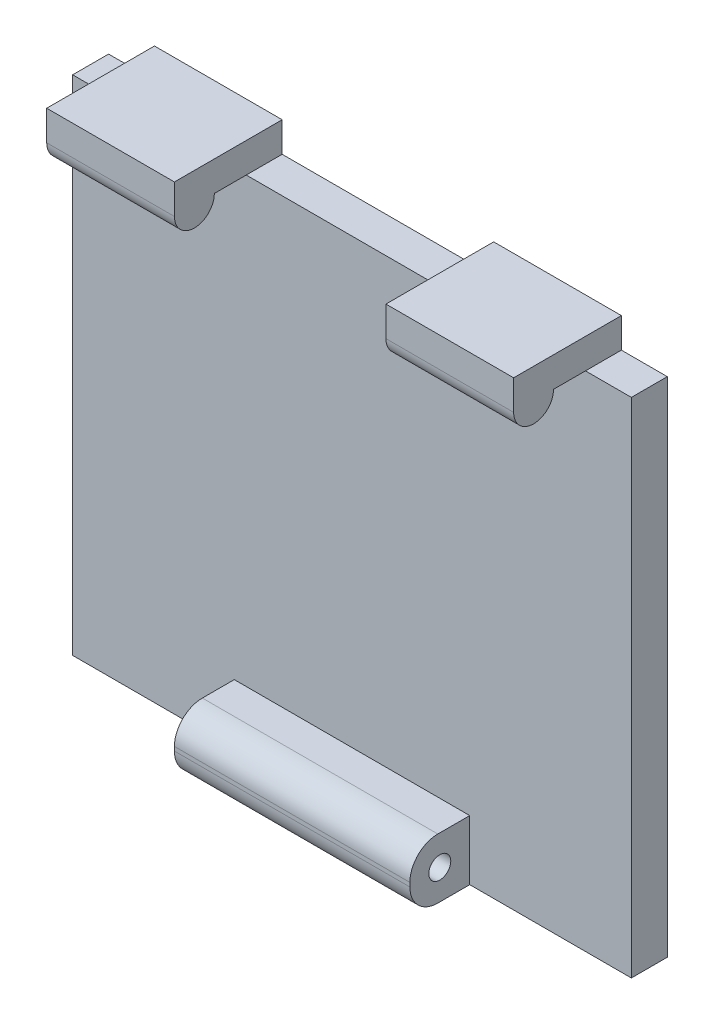
ISO-10303-21;
HEADER;
FILE_DESCRIPTION(('STEP AP214'),'2;1');
FILE_NAME('part.step','',(''),(''),'','','');
FILE_SCHEMA(('AUTOMOTIVE_DESIGN { 1 0 10303 214 1 1 1 1 }'));
ENDSEC;
DATA;
#1=APPLICATION_CONTEXT('core data for automotive mechanical design processes');
#2=APPLICATION_PROTOCOL_DEFINITION('international standard','automotive_design',2000,#1);
#3=PRODUCT_CONTEXT('',#1,'mechanical');
#4=PRODUCT('Part','Part','',(#3));
#5=PRODUCT_RELATED_PRODUCT_CATEGORY('part','',(#4));
#6=PRODUCT_DEFINITION_FORMATION('','',#4);
#7=PRODUCT_DEFINITION_CONTEXT('part definition',#1,'design');
#8=PRODUCT_DEFINITION('design','',#6,#7);
#9=PRODUCT_DEFINITION_SHAPE('','',#8);
#10=(LENGTH_UNIT() NAMED_UNIT(*) SI_UNIT(.MILLI.,.METRE.));
#11=(NAMED_UNIT(*) PLANE_ANGLE_UNIT() SI_UNIT($,.RADIAN.));
#12=(NAMED_UNIT(*) SI_UNIT($,.STERADIAN.) SOLID_ANGLE_UNIT());
#13=UNCERTAINTY_MEASURE_WITH_UNIT(LENGTH_MEASURE(1.E-05),#10,'distance_accuracy_value','');
#14=(GEOMETRIC_REPRESENTATION_CONTEXT(3) GLOBAL_UNCERTAINTY_ASSIGNED_CONTEXT((#13)) GLOBAL_UNIT_ASSIGNED_CONTEXT((#10,
#11,#12)) REPRESENTATION_CONTEXT('',''));
#15=CARTESIAN_POINT('',(0.,0.,0.));
#16=DIRECTION('',(0.,0.,1.));
#17=DIRECTION('',(1.,0.,0.));
#18=AXIS2_PLACEMENT_3D('',#15,#16,#17);
#19=CARTESIAN_POINT('',(0.,0.,1.8));
#20=DIRECTION('',(0.,0.,1.));
#21=DIRECTION('',(1.,0.,0.));
#22=AXIS2_PLACEMENT_3D('',#19,#20,#21);
#23=PLANE('',#22);
#24=DIRECTION('',(-1.,0.,0.));
#25=VECTOR('',#24,1.);
#26=CARTESIAN_POINT('',(0.,0.,1.8));
#27=LINE('',#26,#25);
#28=CARTESIAN_POINT('',(28.,0.,1.8));
#29=VERTEX_POINT('',#28);
#30=CARTESIAN_POINT('',(25.7,0.,1.8));
#31=VERTEX_POINT('',#30);
#32=EDGE_CURVE('E294',#29,#31,#27,.T.);
#33=ORIENTED_EDGE('',*,*,#32,.T.);
#34=DIRECTION('',(1.,0.,0.));
#35=VECTOR('',#34,1.);
#36=CARTESIAN_POINT('',(19.3,0.,1.8));
#37=LINE('',#36,#35);
#38=CARTESIAN_POINT('',(19.3,0.,1.8));
#39=VERTEX_POINT('',#38);
#40=EDGE_CURVE('E391',#39,#31,#37,.T.);
#41=ORIENTED_EDGE('',*,*,#40,.F.);
#42=CARTESIAN_POINT('',(8.7,0.,1.8));
#43=VERTEX_POINT('',#42);
#44=EDGE_CURVE('E298',#39,#43,#27,.T.);
#45=ORIENTED_EDGE('',*,*,#44,.T.);
#46=DIRECTION('',(1.,0.,0.));
#47=VECTOR('',#46,1.);
#48=CARTESIAN_POINT('',(2.3,0.,1.8));
#49=LINE('',#48,#47);
#50=CARTESIAN_POINT('',(2.3,0.,1.8));
#51=VERTEX_POINT('',#50);
#52=EDGE_CURVE('E208',#51,#43,#49,.T.);
#53=ORIENTED_EDGE('',*,*,#52,.F.);
#54=CARTESIAN_POINT('',(0.,0.,1.8));
#55=VERTEX_POINT('',#54);
#56=EDGE_CURVE('E293',#51,#55,#27,.T.);
#57=ORIENTED_EDGE('',*,*,#56,.T.);
#58=DIRECTION('',(0.,-1.,0.));
#59=VECTOR('',#58,1.);
#60=CARTESIAN_POINT('',(0.,0.,1.8));
#61=LINE('',#60,#59);
#62=CARTESIAN_POINT('',(0.,-25.2,1.8));
#63=VERTEX_POINT('',#62);
#64=EDGE_CURVE('E284',#55,#63,#61,.T.);
#65=ORIENTED_EDGE('',*,*,#64,.T.);
#66=DIRECTION('',(1.,0.,0.));
#67=VECTOR('',#66,1.);
#68=CARTESIAN_POINT('',(0.,-25.2,1.8));
#69=LINE('',#68,#67);
#70=CARTESIAN_POINT('',(8.1,-25.2,1.8));
#71=VERTEX_POINT('',#70);
#72=EDGE_CURVE('E288',#63,#71,#69,.T.);
#73=ORIENTED_EDGE('',*,*,#72,.T.);
#74=DIRECTION('',(0.,-1.,0.));
#75=VECTOR('',#74,1.);
#76=CARTESIAN_POINT('',(8.1,-25.2,1.8));
#77=LINE('',#76,#75);
#78=CARTESIAN_POINT('',(8.1,-22.2,1.8));
#79=VERTEX_POINT('',#78);
#80=EDGE_CURVE('E260',#79,#71,#77,.T.);
#81=ORIENTED_EDGE('',*,*,#80,.F.);
#82=DIRECTION('',(-1.,0.,0.));
#83=VECTOR('',#82,1.);
#84=CARTESIAN_POINT('',(8.1,-22.2,1.8));
#85=LINE('',#84,#83);
#86=CARTESIAN_POINT('',(19.9,-22.2,1.8));
#87=VERTEX_POINT('',#86);
#88=EDGE_CURVE('E265',#87,#79,#85,.T.);
#89=ORIENTED_EDGE('',*,*,#88,.F.);
#90=DIRECTION('',(0.,1.,0.));
#91=VECTOR('',#90,1.);
#92=CARTESIAN_POINT('',(19.9,-25.2,1.8));
#93=LINE('',#92,#91);
#94=CARTESIAN_POINT('',(19.9,-25.2,1.8));
#95=VERTEX_POINT('',#94);
#96=EDGE_CURVE('E271',#95,#87,#93,.T.);
#97=ORIENTED_EDGE('',*,*,#96,.F.);
#98=CARTESIAN_POINT('',(28.,-25.2,1.8));
#99=VERTEX_POINT('',#98);
#100=EDGE_CURVE('E287',#95,#99,#69,.T.);
#101=ORIENTED_EDGE('',*,*,#100,.T.);
#102=DIRECTION('',(0.,1.,0.));
#103=VECTOR('',#102,1.);
#104=CARTESIAN_POINT('',(28.,0.,1.8));
#105=LINE('',#104,#103);
#106=EDGE_CURVE('E291',#99,#29,#105,.T.);
#107=ORIENTED_EDGE('',*,*,#106,.T.);
#108=EDGE_LOOP('',(#33,#41,#45,#53,#57,#65,#73,#81,#89,#97,#101,#107));
#109=FACE_BOUND('',#108,.T.);
#110=ADVANCED_FACE('F33',(#109),#23,.T.);
#111=CARTESIAN_POINT('',(0.,0.,1.8));
#112=DIRECTION('',(0.,-1.,0.));
#113=DIRECTION('',(0.,0.,-1.));
#114=AXIS2_PLACEMENT_3D('',#111,#112,#113);
#115=PLANE('',#114);
#116=DIRECTION('',(0.,0.,1.));
#117=VECTOR('',#116,1.);
#118=CARTESIAN_POINT('',(19.3,0.,0.));
#119=LINE('',#118,#117);
#120=CARTESIAN_POINT('',(19.3,0.,0.));
#121=VERTEX_POINT('',#120);
#122=EDGE_CURVE('E221',#121,#39,#119,.T.);
#123=ORIENTED_EDGE('',*,*,#122,.F.);
#124=DIRECTION('',(-1.,0.,0.));
#125=VECTOR('',#124,1.);
#126=CARTESIAN_POINT('',(0.,0.,0.));
#127=LINE('',#126,#125);
#128=CARTESIAN_POINT('',(8.7,0.,0.));
#129=VERTEX_POINT('',#128);
#130=EDGE_CURVE('E307',#121,#129,#127,.T.);
#131=ORIENTED_EDGE('',*,*,#130,.T.);
#132=DIRECTION('',(0.,0.,-1.));
#133=VECTOR('',#132,1.);
#134=CARTESIAN_POINT('',(8.7,0.,0.));
#135=LINE('',#134,#133);
#136=EDGE_CURVE('E241',#43,#129,#135,.T.);
#137=ORIENTED_EDGE('',*,*,#136,.F.);
#138=ORIENTED_EDGE('',*,*,#44,.F.);
#139=EDGE_LOOP('',(#123,#131,#137,#138));
#140=FACE_BOUND('',#139,.T.);
#141=ADVANCED_FACE('F400',(#140),#115,.F.);
#142=DIRECTION('',(0.,0.,-1.));
#143=VECTOR('',#142,1.);
#144=CARTESIAN_POINT('',(25.7,0.,0.));
#145=LINE('',#144,#143);
#146=CARTESIAN_POINT('',(25.7,0.,0.));
#147=VERTEX_POINT('',#146);
#148=EDGE_CURVE('E225',#31,#147,#145,.T.);
#149=ORIENTED_EDGE('',*,*,#148,.F.);
#150=ORIENTED_EDGE('',*,*,#32,.F.);
#151=DIRECTION('',(0.,0.,-1.));
#152=VECTOR('',#151,1.);
#153=CARTESIAN_POINT('',(28.,0.,1.8));
#154=LINE('',#153,#152);
#155=CARTESIAN_POINT('',(28.,0.,0.));
#156=VERTEX_POINT('',#155);
#157=EDGE_CURVE('E310',#29,#156,#154,.T.);
#158=ORIENTED_EDGE('',*,*,#157,.T.);
#159=EDGE_CURVE('E48',#156,#147,#127,.T.);
#160=ORIENTED_EDGE('',*,*,#159,.T.);
#161=EDGE_LOOP('',(#149,#150,#158,#160));
#162=FACE_BOUND('',#161,.T.);
#163=ADVANCED_FACE('F388',(#162),#115,.F.);
#164=DIRECTION('',(0.,0.,1.));
#165=VECTOR('',#164,1.);
#166=CARTESIAN_POINT('',(2.3,0.,0.));
#167=LINE('',#166,#165);
#168=CARTESIAN_POINT('',(2.3,0.,0.));
#169=VERTEX_POINT('',#168);
#170=EDGE_CURVE('E56',#169,#51,#167,.T.);
#171=ORIENTED_EDGE('',*,*,#170,.F.);
#172=CARTESIAN_POINT('',(0.,0.,0.));
#173=VERTEX_POINT('',#172);
#174=EDGE_CURVE('E305',#169,#173,#127,.T.);
#175=ORIENTED_EDGE('',*,*,#174,.T.);
#176=DIRECTION('',(0.,0.,-1.));
#177=VECTOR('',#176,1.);
#178=CARTESIAN_POINT('',(0.,0.,1.8));
#179=LINE('',#178,#177);
#180=EDGE_CURVE('E297',#55,#173,#179,.T.);
#181=ORIENTED_EDGE('',*,*,#180,.F.);
#182=ORIENTED_EDGE('',*,*,#56,.F.);
#183=EDGE_LOOP('',(#171,#175,#181,#182));
#184=FACE_BOUND('',#183,.T.);
#185=ADVANCED_FACE('F409',(#184),#115,.F.);
#186=CARTESIAN_POINT('',(0.,0.,1.8));
#187=DIRECTION('',(1.,0.,0.));
#188=DIRECTION('',(0.,1.,0.));
#189=AXIS2_PLACEMENT_3D('',#186,#187,#188);
#190=PLANE('',#189);
#191=DIRECTION('',(0.,-1.,0.));
#192=VECTOR('',#191,1.);
#193=CARTESIAN_POINT('',(0.,0.,0.));
#194=LINE('',#193,#192);
#195=CARTESIAN_POINT('',(0.,-25.2,0.));
#196=VERTEX_POINT('',#195);
#197=EDGE_CURVE('E283',#173,#196,#194,.T.);
#198=ORIENTED_EDGE('',*,*,#197,.T.);
#199=DIRECTION('',(0.,0.,-1.));
#200=VECTOR('',#199,1.);
#201=CARTESIAN_POINT('',(0.,-25.2,1.8));
#202=LINE('',#201,#200);
#203=EDGE_CURVE('E315',#63,#196,#202,.T.);
#204=ORIENTED_EDGE('',*,*,#203,.F.);
#205=ORIENTED_EDGE('',*,*,#64,.F.);
#206=ORIENTED_EDGE('',*,*,#180,.T.);
#207=EDGE_LOOP('',(#198,#204,#205,#206));
#208=FACE_BOUND('',#207,.T.);
#209=ADVANCED_FACE('F367',(#208),#190,.F.);
#210=CARTESIAN_POINT('',(0.,-25.2,1.8));
#211=DIRECTION('',(0.,1.,0.));
#212=DIRECTION('',(0.,0.,1.));
#213=AXIS2_PLACEMENT_3D('',#210,#211,#212);
#214=PLANE('',#213);
#215=DIRECTION('',(0.,0.,-1.));
#216=VECTOR('',#215,1.);
#217=CARTESIAN_POINT('',(19.9,-25.2,4.8));
#218=LINE('',#217,#216);
#219=CARTESIAN_POINT('',(19.9,-25.2,3.4));
#220=VERTEX_POINT('',#219);
#221=EDGE_CURVE('E279',#220,#95,#218,.T.);
#222=ORIENTED_EDGE('',*,*,#221,.F.);
#223=DIRECTION('',(1.,0.,0.));
#224=VECTOR('',#223,1.);
#225=CARTESIAN_POINT('',(0.,-25.2,3.4));
#226=LINE('',#225,#224);
#227=CARTESIAN_POINT('',(8.1,-25.2,3.4));
#228=VERTEX_POINT('',#227);
#229=EDGE_CURVE('E11',#220,#228,#226,.F.);
#230=ORIENTED_EDGE('',*,*,#229,.T.);
#231=DIRECTION('',(0.,0.,-1.));
#232=VECTOR('',#231,1.);
#233=CARTESIAN_POINT('',(8.1,-25.2,4.8));
#234=LINE('',#233,#232);
#235=EDGE_CURVE('E281',#228,#71,#234,.T.);
#236=ORIENTED_EDGE('',*,*,#235,.T.);
#237=ORIENTED_EDGE('',*,*,#72,.F.);
#238=ORIENTED_EDGE('',*,*,#203,.T.);
#239=DIRECTION('',(1.,0.,0.));
#240=VECTOR('',#239,1.);
#241=CARTESIAN_POINT('',(0.,-25.2,0.));
#242=LINE('',#241,#240);
#243=CARTESIAN_POINT('',(28.,-25.2,0.));
#244=VERTEX_POINT('',#243);
#245=EDGE_CURVE('E301',#196,#244,#242,.T.);
#246=ORIENTED_EDGE('',*,*,#245,.T.);
#247=DIRECTION('',(0.,0.,-1.));
#248=VECTOR('',#247,1.);
#249=CARTESIAN_POINT('',(28.,-25.2,1.8));
#250=LINE('',#249,#248);
#251=EDGE_CURVE('E312',#99,#244,#250,.T.);
#252=ORIENTED_EDGE('',*,*,#251,.F.);
#253=ORIENTED_EDGE('',*,*,#100,.F.);
#254=EDGE_LOOP('',(#222,#230,#236,#237,#238,#246,#252,#253));
#255=FACE_BOUND('',#254,.T.);
#256=ADVANCED_FACE('F357',(#255),#214,.F.);
#257=CARTESIAN_POINT('',(28.,0.,1.8));
#258=DIRECTION('',(-1.,0.,0.));
#259=DIRECTION('',(0.,-1.,0.));
#260=AXIS2_PLACEMENT_3D('',#257,#258,#259);
#261=PLANE('',#260);
#262=DIRECTION('',(0.,1.,0.));
#263=VECTOR('',#262,1.);
#264=CARTESIAN_POINT('',(28.,0.,0.));
#265=LINE('',#264,#263);
#266=EDGE_CURVE('E303',#244,#156,#265,.T.);
#267=ORIENTED_EDGE('',*,*,#266,.T.);
#268=ORIENTED_EDGE('',*,*,#157,.F.);
#269=ORIENTED_EDGE('',*,*,#106,.F.);
#270=ORIENTED_EDGE('',*,*,#251,.T.);
#271=EDGE_LOOP('',(#267,#268,#269,#270));
#272=FACE_BOUND('',#271,.T.);
#273=ADVANCED_FACE('F373',(#272),#261,.F.);
#274=CARTESIAN_POINT('',(0.,0.,0.));
#275=DIRECTION('',(0.,0.,1.));
#276=DIRECTION('',(1.,0.,0.));
#277=AXIS2_PLACEMENT_3D('',#274,#275,#276);
#278=PLANE('',#277);
#279=ORIENTED_EDGE('',*,*,#197,.F.);
#280=ORIENTED_EDGE('',*,*,#174,.F.);
#281=DIRECTION('',(0.,-1.,0.));
#282=VECTOR('',#281,1.);
#283=CARTESIAN_POINT('',(2.3,1.5,0.));
#284=LINE('',#283,#282);
#285=CARTESIAN_POINT('',(2.3,1.5,0.));
#286=VERTEX_POINT('',#285);
#287=EDGE_CURVE('E245',#286,#169,#284,.T.);
#288=ORIENTED_EDGE('',*,*,#287,.F.);
#289=DIRECTION('',(-1.,0.,0.));
#290=VECTOR('',#289,1.);
#291=CARTESIAN_POINT('',(2.3,1.5,0.));
#292=LINE('',#291,#290);
#293=CARTESIAN_POINT('',(8.7,1.5,0.));
#294=VERTEX_POINT('',#293);
#295=EDGE_CURVE('E243',#294,#286,#292,.T.);
#296=ORIENTED_EDGE('',*,*,#295,.F.);
#297=DIRECTION('',(0.,-1.,0.));
#298=VECTOR('',#297,1.);
#299=CARTESIAN_POINT('',(8.7,1.5,0.));
#300=LINE('',#299,#298);
#301=EDGE_CURVE('E251',#294,#129,#300,.T.);
#302=ORIENTED_EDGE('',*,*,#301,.T.);
#303=ORIENTED_EDGE('',*,*,#130,.F.);
#304=DIRECTION('',(0.,-1.,0.));
#305=VECTOR('',#304,1.);
#306=CARTESIAN_POINT('',(19.3,1.5,0.));
#307=LINE('',#306,#305);
#308=CARTESIAN_POINT('',(19.3,1.5,0.));
#309=VERTEX_POINT('',#308);
#310=EDGE_CURVE('E229',#309,#121,#307,.T.);
#311=ORIENTED_EDGE('',*,*,#310,.F.);
#312=DIRECTION('',(-1.,0.,0.));
#313=VECTOR('',#312,1.);
#314=CARTESIAN_POINT('',(19.3,1.5,0.));
#315=LINE('',#314,#313);
#316=CARTESIAN_POINT('',(25.7,1.5,0.));
#317=VERTEX_POINT('',#316);
#318=EDGE_CURVE('E227',#317,#309,#315,.T.);
#319=ORIENTED_EDGE('',*,*,#318,.F.);
#320=DIRECTION('',(0.,-1.,0.));
#321=VECTOR('',#320,1.);
#322=CARTESIAN_POINT('',(25.7,1.5,0.));
#323=LINE('',#322,#321);
#324=EDGE_CURVE('E235',#317,#147,#323,.T.);
#325=ORIENTED_EDGE('',*,*,#324,.T.);
#326=ORIENTED_EDGE('',*,*,#159,.F.);
#327=ORIENTED_EDGE('',*,*,#266,.F.);
#328=ORIENTED_EDGE('',*,*,#245,.F.);
#329=EDGE_LOOP('',(#279,#280,#288,#296,#302,#303,#311,#319,#325,#326,#327,#328));
#330=FACE_BOUND('',#329,.T.);
#331=ADVANCED_FACE('F375',(#330),#278,.F.);
#332=CARTESIAN_POINT('',(8.1,-25.2,4.8));
#333=DIRECTION('',(1.,0.,0.));
#334=DIRECTION('',(0.,0.,-1.));
#335=AXIS2_PLACEMENT_3D('',#332,#333,#334);
#336=PLANE('',#335);
#337=CARTESIAN_POINT('',(8.1,-23.7,3.3));
#338=DIRECTION('',(1.,0.,0.));
#339=DIRECTION('',(0.,0.,-1.));
#340=AXIS2_PLACEMENT_3D('',#337,#338,#339);
#341=CIRCLE('',#340,0.549999999999998);
#342=CARTESIAN_POINT('',(8.1,-23.7,2.75));
#343=VERTEX_POINT('',#342);
#344=EDGE_CURVE('E257',#343,#343,#341,.T.);
#345=ORIENTED_EDGE('',*,*,#344,.T.);
#346=EDGE_LOOP('',(#345));
#347=FACE_BOUND('',#346,.T.);
#348=DIRECTION('',(0.,-1.,0.));
#349=VECTOR('',#348,1.);
#350=CARTESIAN_POINT('',(8.1,-25.2,4.8));
#351=LINE('',#350,#349);
#352=CARTESIAN_POINT('',(8.1,-23.6,4.8));
#353=VERTEX_POINT('',#352);
#354=CARTESIAN_POINT('',(8.1,-23.8,4.8));
#355=VERTEX_POINT('',#354);
#356=EDGE_CURVE('E261',#353,#355,#351,.T.);
#357=ORIENTED_EDGE('',*,*,#356,.F.);
#358=CARTESIAN_POINT('',(8.1,-23.6,3.4));
#359=DIRECTION('',(1.,0.,0.));
#360=DIRECTION('',(0.,0.,-1.));
#361=AXIS2_PLACEMENT_3D('',#358,#359,#360);
#362=CIRCLE('',#361,1.4);
#363=CARTESIAN_POINT('',(8.1,-22.2,3.4));
#364=VERTEX_POINT('',#363);
#365=EDGE_CURVE('E326',#353,#364,#362,.F.);
#366=ORIENTED_EDGE('',*,*,#365,.T.);
#367=DIRECTION('',(0.,0.,-1.));
#368=VECTOR('',#367,1.);
#369=CARTESIAN_POINT('',(8.1,-22.2,4.8));
#370=LINE('',#369,#368);
#371=EDGE_CURVE('E268',#364,#79,#370,.T.);
#372=ORIENTED_EDGE('',*,*,#371,.T.);
#373=ORIENTED_EDGE('',*,*,#80,.T.);
#374=ORIENTED_EDGE('',*,*,#235,.F.);
#375=CARTESIAN_POINT('',(8.1,-23.8,3.4));
#376=DIRECTION('',(1.,0.,0.));
#377=DIRECTION('',(0.,0.,-1.));
#378=AXIS2_PLACEMENT_3D('',#375,#376,#377);
#379=CIRCLE('',#378,1.4);
#380=EDGE_CURVE('E324',#228,#355,#379,.F.);
#381=ORIENTED_EDGE('',*,*,#380,.T.);
#382=EDGE_LOOP('',(#357,#366,#372,#373,#374,#381));
#383=FACE_BOUND('',#382,.T.);
#384=ADVANCED_FACE('F346',(#347,#383),#336,.F.);
#385=CARTESIAN_POINT('',(19.9,-25.2,4.8));
#386=DIRECTION('',(-1.,0.,0.));
#387=DIRECTION('',(0.,0.,1.));
#388=AXIS2_PLACEMENT_3D('',#385,#386,#387);
#389=PLANE('',#388);
#390=CARTESIAN_POINT('',(19.9,-23.7,3.3));
#391=DIRECTION('',(1.,0.,0.));
#392=DIRECTION('',(0.,0.,-1.));
#393=AXIS2_PLACEMENT_3D('',#390,#391,#392);
#394=CIRCLE('',#393,0.549999999999998);
#395=CARTESIAN_POINT('',(19.9,-23.7,2.75));
#396=VERTEX_POINT('',#395);
#397=EDGE_CURVE('E254',#396,#396,#394,.T.);
#398=ORIENTED_EDGE('',*,*,#397,.F.);
#399=EDGE_LOOP('',(#398));
#400=FACE_BOUND('',#399,.T.);
#401=DIRECTION('',(0.,0.,-1.));
#402=VECTOR('',#401,1.);
#403=CARTESIAN_POINT('',(19.9,-22.2,4.8));
#404=LINE('',#403,#402);
#405=CARTESIAN_POINT('',(19.9,-22.2,3.4));
#406=VERTEX_POINT('',#405);
#407=EDGE_CURVE('E277',#406,#87,#404,.T.);
#408=ORIENTED_EDGE('',*,*,#407,.F.);
#409=CARTESIAN_POINT('',(19.9,-23.6,3.4));
#410=DIRECTION('',(-1.,0.,0.));
#411=DIRECTION('',(0.,0.,1.));
#412=AXIS2_PLACEMENT_3D('',#409,#410,#411);
#413=CIRCLE('',#412,1.4);
#414=CARTESIAN_POINT('',(19.9,-23.6,4.8));
#415=VERTEX_POINT('',#414);
#416=EDGE_CURVE('E41',#406,#415,#413,.F.);
#417=ORIENTED_EDGE('',*,*,#416,.T.);
#418=DIRECTION('',(0.,1.,0.));
#419=VECTOR('',#418,1.);
#420=CARTESIAN_POINT('',(19.9,-25.2,4.8));
#421=LINE('',#420,#419);
#422=CARTESIAN_POINT('',(19.9,-23.8,4.8));
#423=VERTEX_POINT('',#422);
#424=EDGE_CURVE('E264',#423,#415,#421,.T.);
#425=ORIENTED_EDGE('',*,*,#424,.F.);
#426=CARTESIAN_POINT('',(19.9,-23.8,3.4));
#427=DIRECTION('',(-1.,0.,0.));
#428=DIRECTION('',(0.,0.,1.));
#429=AXIS2_PLACEMENT_3D('',#426,#427,#428);
#430=CIRCLE('',#429,1.4);
#431=EDGE_CURVE('E330',#423,#220,#430,.F.);
#432=ORIENTED_EDGE('',*,*,#431,.T.);
#433=ORIENTED_EDGE('',*,*,#221,.T.);
#434=ORIENTED_EDGE('',*,*,#96,.T.);
#435=EDGE_LOOP('',(#408,#417,#425,#432,#433,#434));
#436=FACE_BOUND('',#435,.T.);
#437=ADVANCED_FACE('F335',(#400,#436),#389,.F.);
#438=CARTESIAN_POINT('',(8.1,-22.2,4.8));
#439=DIRECTION('',(0.,-1.,0.));
#440=DIRECTION('',(0.,0.,-1.));
#441=AXIS2_PLACEMENT_3D('',#438,#439,#440);
#442=PLANE('',#441);
#443=ORIENTED_EDGE('',*,*,#371,.F.);
#444=DIRECTION('',(-1.,0.,0.));
#445=VECTOR('',#444,1.);
#446=CARTESIAN_POINT('',(8.1,-22.2,3.4));
#447=LINE('',#446,#445);
#448=EDGE_CURVE('E328',#364,#406,#447,.F.);
#449=ORIENTED_EDGE('',*,*,#448,.T.);
#450=ORIENTED_EDGE('',*,*,#407,.T.);
#451=ORIENTED_EDGE('',*,*,#88,.T.);
#452=EDGE_LOOP('',(#443,#449,#450,#451));
#453=FACE_BOUND('',#452,.T.);
#454=ADVANCED_FACE('F349',(#453),#442,.F.);
#455=CARTESIAN_POINT('',(0.,0.,4.8));
#456=DIRECTION('',(0.,0.,-1.));
#457=DIRECTION('',(-1.,0.,0.));
#458=AXIS2_PLACEMENT_3D('',#455,#456,#457);
#459=PLANE('',#458);
#460=ORIENTED_EDGE('',*,*,#424,.T.);
#461=DIRECTION('',(-1.,0.,0.));
#462=VECTOR('',#461,1.);
#463=CARTESIAN_POINT('',(0.,-23.6,4.8));
#464=LINE('',#463,#462);
#465=EDGE_CURVE('E321',#415,#353,#464,.T.);
#466=ORIENTED_EDGE('',*,*,#465,.T.);
#467=ORIENTED_EDGE('',*,*,#356,.T.);
#468=DIRECTION('',(1.,0.,0.));
#469=VECTOR('',#468,1.);
#470=CARTESIAN_POINT('',(0.,-23.8,4.8));
#471=LINE('',#470,#469);
#472=EDGE_CURVE('E318',#355,#423,#471,.T.);
#473=ORIENTED_EDGE('',*,*,#472,.T.);
#474=EDGE_LOOP('',(#460,#466,#467,#473));
#475=FACE_BOUND('',#474,.T.);
#476=ADVANCED_FACE('F340',(#475),#459,.F.);
#477=CARTESIAN_POINT('',(0.,-23.6,3.4));
#478=DIRECTION('',(-1.,0.,0.));
#479=DIRECTION('',(0.,0.,1.));
#480=AXIS2_PLACEMENT_3D('',#477,#478,#479);
#481=CYLINDRICAL_SURFACE('',#480,1.4);
#482=ORIENTED_EDGE('',*,*,#416,.F.);
#483=ORIENTED_EDGE('',*,*,#448,.F.);
#484=ORIENTED_EDGE('',*,*,#365,.F.);
#485=ORIENTED_EDGE('',*,*,#465,.F.);
#486=EDGE_LOOP('',(#482,#483,#484,#485));
#487=FACE_BOUND('',#486,.T.);
#488=ADVANCED_FACE('F343',(#487),#481,.T.);
#489=CARTESIAN_POINT('',(0.,-23.8,3.4));
#490=DIRECTION('',(1.,0.,0.));
#491=DIRECTION('',(0.,0.,-1.));
#492=AXIS2_PLACEMENT_3D('',#489,#490,#491);
#493=CYLINDRICAL_SURFACE('',#492,1.4);
#494=ORIENTED_EDGE('',*,*,#380,.F.);
#495=ORIENTED_EDGE('',*,*,#229,.F.);
#496=ORIENTED_EDGE('',*,*,#431,.F.);
#497=ORIENTED_EDGE('',*,*,#472,.F.);
#498=EDGE_LOOP('',(#494,#495,#496,#497));
#499=FACE_BOUND('',#498,.T.);
#500=ADVANCED_FACE('F35',(#499),#493,.T.);
#501=CARTESIAN_POINT('',(0.,-23.7,3.3));
#502=DIRECTION('',(1.,0.,0.));
#503=DIRECTION('',(0.,0.,-1.));
#504=AXIS2_PLACEMENT_3D('',#501,#502,#503);
#505=CYLINDRICAL_SURFACE('',#504,0.549999999999998);
#506=ORIENTED_EDGE('',*,*,#397,.T.);
#507=EDGE_LOOP('',(#506));
#508=FACE_BOUND('',#507,.T.);
#509=ORIENTED_EDGE('',*,*,#344,.F.);
#510=EDGE_LOOP('',(#509));
#511=FACE_BOUND('',#510,.T.);
#512=ADVANCED_FACE('F475',(#508,#511),#505,.F.);
#513=CARTESIAN_POINT('',(2.3,1.5,0.));
#514=DIRECTION('',(1.,0.,0.));
#515=DIRECTION('',(0.,0.,-1.));
#516=AXIS2_PLACEMENT_3D('',#513,#514,#515);
#517=PLANE('',#516);
#518=DIRECTION('',(0.,0.,-1.));
#519=VECTOR('',#518,1.);
#520=CARTESIAN_POINT('',(2.3,0.,5.4));
#521=LINE('',#520,#519);
#522=CARTESIAN_POINT('',(2.3,0.,3.4));
#523=VERTEX_POINT('',#522);
#524=EDGE_CURVE('E202',#523,#51,#521,.T.);
#525=ORIENTED_EDGE('',*,*,#524,.F.);
#526=CARTESIAN_POINT('',(2.3,0.,4.4));
#527=DIRECTION('',(-1.,0.,0.));
#528=DIRECTION('',(0.,0.,1.));
#529=AXIS2_PLACEMENT_3D('',#526,#527,#528);
#530=CIRCLE('',#529,1.);
#531=CARTESIAN_POINT('',(2.3,0.,5.4));
#532=VERTEX_POINT('',#531);
#533=EDGE_CURVE('E186',#523,#532,#530,.T.);
#534=ORIENTED_EDGE('',*,*,#533,.T.);
#535=DIRECTION('',(0.,-1.,0.));
#536=VECTOR('',#535,1.);
#537=CARTESIAN_POINT('',(2.3,1.5,5.4));
#538=LINE('',#537,#536);
#539=CARTESIAN_POINT('',(2.3,1.5,5.4));
#540=VERTEX_POINT('',#539);
#541=EDGE_CURVE('E195',#540,#532,#538,.T.);
#542=ORIENTED_EDGE('',*,*,#541,.F.);
#543=DIRECTION('',(0.,0.,1.));
#544=VECTOR('',#543,1.);
#545=CARTESIAN_POINT('',(2.3,1.5,0.));
#546=LINE('',#545,#544);
#547=EDGE_CURVE('E238',#286,#540,#546,.T.);
#548=ORIENTED_EDGE('',*,*,#547,.F.);
#549=ORIENTED_EDGE('',*,*,#287,.T.);
#550=ORIENTED_EDGE('',*,*,#170,.T.);
#551=EDGE_LOOP('',(#525,#534,#542,#548,#549,#550));
#552=FACE_BOUND('',#551,.T.);
#553=ADVANCED_FACE('F200',(#552),#517,.F.);
#554=CARTESIAN_POINT('',(8.7,1.5,0.));
#555=DIRECTION('',(-1.,0.,0.));
#556=DIRECTION('',(0.,0.,1.));
#557=AXIS2_PLACEMENT_3D('',#554,#555,#556);
#558=PLANE('',#557);
#559=DIRECTION('',(0.,1.,0.));
#560=VECTOR('',#559,1.);
#561=CARTESIAN_POINT('',(8.7,1.5,5.4));
#562=LINE('',#561,#560);
#563=CARTESIAN_POINT('',(8.7,0.,5.4));
#564=VERTEX_POINT('',#563);
#565=CARTESIAN_POINT('',(8.7,1.5,5.4));
#566=VERTEX_POINT('',#565);
#567=EDGE_CURVE('E194',#564,#566,#562,.T.);
#568=ORIENTED_EDGE('',*,*,#567,.F.);
#569=CARTESIAN_POINT('',(8.7,0.,4.4));
#570=DIRECTION('',(-1.,0.,0.));
#571=DIRECTION('',(0.,0.,1.));
#572=AXIS2_PLACEMENT_3D('',#569,#570,#571);
#573=CIRCLE('',#572,1.);
#574=CARTESIAN_POINT('',(8.7,0.,3.4));
#575=VERTEX_POINT('',#574);
#576=EDGE_CURVE('E189',#575,#564,#573,.T.);
#577=ORIENTED_EDGE('',*,*,#576,.F.);
#578=DIRECTION('',(0.,0.,-1.));
#579=VECTOR('',#578,1.);
#580=CARTESIAN_POINT('',(8.7,0.,5.4));
#581=LINE('',#580,#579);
#582=EDGE_CURVE('E217',#575,#43,#581,.T.);
#583=ORIENTED_EDGE('',*,*,#582,.T.);
#584=ORIENTED_EDGE('',*,*,#136,.T.);
#585=ORIENTED_EDGE('',*,*,#301,.F.);
#586=DIRECTION('',(0.,0.,-1.));
#587=VECTOR('',#586,1.);
#588=CARTESIAN_POINT('',(8.7,1.5,0.));
#589=LINE('',#588,#587);
#590=EDGE_CURVE('E240',#566,#294,#589,.T.);
#591=ORIENTED_EDGE('',*,*,#590,.F.);
#592=EDGE_LOOP('',(#568,#577,#583,#584,#585,#591));
#593=FACE_BOUND('',#592,.T.);
#594=ADVANCED_FACE('F414',(#593),#558,.F.);
#595=CARTESIAN_POINT('',(0.,1.5,0.));
#596=DIRECTION('',(0.,1.,0.));
#597=DIRECTION('',(0.,0.,1.));
#598=AXIS2_PLACEMENT_3D('',#595,#596,#597);
#599=PLANE('',#598);
#600=ORIENTED_EDGE('',*,*,#547,.T.);
#601=DIRECTION('',(-1.,0.,0.));
#602=VECTOR('',#601,1.);
#603=CARTESIAN_POINT('',(2.3,1.5,5.4));
#604=LINE('',#603,#602);
#605=EDGE_CURVE('E207',#566,#540,#604,.T.);
#606=ORIENTED_EDGE('',*,*,#605,.F.);
#607=ORIENTED_EDGE('',*,*,#590,.T.);
#608=ORIENTED_EDGE('',*,*,#295,.T.);
#609=EDGE_LOOP('',(#600,#606,#607,#608));
#610=FACE_BOUND('',#609,.T.);
#611=ADVANCED_FACE('F412',(#610),#599,.T.);
#612=CARTESIAN_POINT('',(19.3,1.5,0.));
#613=DIRECTION('',(1.,0.,0.));
#614=DIRECTION('',(0.,0.,-1.));
#615=AXIS2_PLACEMENT_3D('',#612,#613,#614);
#616=PLANE('',#615);
#617=DIRECTION('',(0.,0.,-1.));
#618=VECTOR('',#617,1.);
#619=CARTESIAN_POINT('',(19.3,0.,5.4));
#620=LINE('',#619,#618);
#621=CARTESIAN_POINT('',(19.3,0.,3.4));
#622=VERTEX_POINT('',#621);
#623=EDGE_CURVE('E211',#622,#39,#620,.T.);
#624=ORIENTED_EDGE('',*,*,#623,.F.);
#625=CARTESIAN_POINT('',(19.3,0.,4.4));
#626=DIRECTION('',(1.,0.,0.));
#627=DIRECTION('',(0.,0.,-1.));
#628=AXIS2_PLACEMENT_3D('',#625,#626,#627);
#629=CIRCLE('',#628,1.);
#630=CARTESIAN_POINT('',(19.3,0.,5.4));
#631=VERTEX_POINT('',#630);
#632=EDGE_CURVE('E421',#631,#622,#629,.T.);
#633=ORIENTED_EDGE('',*,*,#632,.F.);
#634=DIRECTION('',(0.,-1.,0.));
#635=VECTOR('',#634,1.);
#636=CARTESIAN_POINT('',(19.3,1.5,5.4));
#637=LINE('',#636,#635);
#638=CARTESIAN_POINT('',(19.3,1.5,5.4));
#639=VERTEX_POINT('',#638);
#640=EDGE_CURVE('E395',#639,#631,#637,.T.);
#641=ORIENTED_EDGE('',*,*,#640,.F.);
#642=DIRECTION('',(0.,0.,1.));
#643=VECTOR('',#642,1.);
#644=CARTESIAN_POINT('',(19.3,1.5,0.));
#645=LINE('',#644,#643);
#646=EDGE_CURVE('E222',#309,#639,#645,.T.);
#647=ORIENTED_EDGE('',*,*,#646,.F.);
#648=ORIENTED_EDGE('',*,*,#310,.T.);
#649=ORIENTED_EDGE('',*,*,#122,.T.);
#650=EDGE_LOOP('',(#624,#633,#641,#647,#648,#649));
#651=FACE_BOUND('',#650,.T.);
#652=ADVANCED_FACE('F403',(#651),#616,.F.);
#653=CARTESIAN_POINT('',(25.7,1.5,0.));
#654=DIRECTION('',(-1.,0.,0.));
#655=DIRECTION('',(0.,0.,1.));
#656=AXIS2_PLACEMENT_3D('',#653,#654,#655);
#657=PLANE('',#656);
#658=DIRECTION('',(0.,1.,0.));
#659=VECTOR('',#658,1.);
#660=CARTESIAN_POINT('',(25.7,1.5,5.4));
#661=LINE('',#660,#659);
#662=CARTESIAN_POINT('',(25.7,0.,5.4));
#663=VERTEX_POINT('',#662);
#664=CARTESIAN_POINT('',(25.7,1.5,5.4));
#665=VERTEX_POINT('',#664);
#666=EDGE_CURVE('E433',#663,#665,#661,.T.);
#667=ORIENTED_EDGE('',*,*,#666,.F.);
#668=CARTESIAN_POINT('',(25.7,0.,4.4));
#669=DIRECTION('',(1.,0.,0.));
#670=DIRECTION('',(0.,0.,-1.));
#671=AXIS2_PLACEMENT_3D('',#668,#669,#670);
#672=CIRCLE('',#671,1.);
#673=CARTESIAN_POINT('',(25.7,0.,3.4));
#674=VERTEX_POINT('',#673);
#675=EDGE_CURVE('E419',#663,#674,#672,.T.);
#676=ORIENTED_EDGE('',*,*,#675,.T.);
#677=DIRECTION('',(0.,0.,-1.));
#678=VECTOR('',#677,1.);
#679=CARTESIAN_POINT('',(25.7,0.,5.4));
#680=LINE('',#679,#678);
#681=EDGE_CURVE('E385',#674,#31,#680,.T.);
#682=ORIENTED_EDGE('',*,*,#681,.T.);
#683=ORIENTED_EDGE('',*,*,#148,.T.);
#684=ORIENTED_EDGE('',*,*,#324,.F.);
#685=DIRECTION('',(0.,0.,-1.));
#686=VECTOR('',#685,1.);
#687=CARTESIAN_POINT('',(25.7,1.5,0.));
#688=LINE('',#687,#686);
#689=EDGE_CURVE('E224',#665,#317,#688,.T.);
#690=ORIENTED_EDGE('',*,*,#689,.F.);
#691=EDGE_LOOP('',(#667,#676,#682,#683,#684,#690));
#692=FACE_BOUND('',#691,.T.);
#693=ADVANCED_FACE('F381',(#692),#657,.F.);
#694=CARTESIAN_POINT('',(0.,1.5,0.));
#695=DIRECTION('',(0.,1.,0.));
#696=DIRECTION('',(0.,0.,1.));
#697=AXIS2_PLACEMENT_3D('',#694,#695,#696);
#698=PLANE('',#697);
#699=ORIENTED_EDGE('',*,*,#646,.T.);
#700=DIRECTION('',(-1.,0.,0.));
#701=VECTOR('',#700,1.);
#702=CARTESIAN_POINT('',(19.3,1.5,5.4));
#703=LINE('',#702,#701);
#704=EDGE_CURVE('E435',#665,#639,#703,.T.);
#705=ORIENTED_EDGE('',*,*,#704,.F.);
#706=ORIENTED_EDGE('',*,*,#689,.T.);
#707=ORIENTED_EDGE('',*,*,#318,.T.);
#708=EDGE_LOOP('',(#699,#705,#706,#707));
#709=FACE_BOUND('',#708,.T.);
#710=ADVANCED_FACE('F444',(#709),#698,.T.);
#711=CARTESIAN_POINT('',(2.3,0.,5.4));
#712=DIRECTION('',(0.,1.,0.));
#713=DIRECTION('',(0.,0.,1.));
#714=AXIS2_PLACEMENT_3D('',#711,#712,#713);
#715=PLANE('',#714);
#716=ORIENTED_EDGE('',*,*,#582,.F.);
#717=DIRECTION('',(-1.,0.,0.));
#718=VECTOR('',#717,1.);
#719=CARTESIAN_POINT('',(8.7,0.,3.4));
#720=LINE('',#719,#718);
#721=EDGE_CURVE('E418',#575,#523,#720,.T.);
#722=ORIENTED_EDGE('',*,*,#721,.T.);
#723=ORIENTED_EDGE('',*,*,#524,.T.);
#724=ORIENTED_EDGE('',*,*,#52,.T.);
#725=EDGE_LOOP('',(#716,#722,#723,#724));
#726=FACE_BOUND('',#725,.T.);
#727=ADVANCED_FACE('F417',(#726),#715,.F.);
#728=CARTESIAN_POINT('',(0.,0.,5.4));
#729=DIRECTION('',(0.,0.,1.));
#730=DIRECTION('',(1.,0.,0.));
#731=AXIS2_PLACEMENT_3D('',#728,#729,#730);
#732=PLANE('',#731);
#733=ORIENTED_EDGE('',*,*,#541,.T.);
#734=DIRECTION('',(1.,0.,0.));
#735=VECTOR('',#734,1.);
#736=CARTESIAN_POINT('',(2.3,0.,5.4));
#737=LINE('',#736,#735);
#738=EDGE_CURVE('E183',#532,#564,#737,.T.);
#739=ORIENTED_EDGE('',*,*,#738,.T.);
#740=ORIENTED_EDGE('',*,*,#567,.T.);
#741=ORIENTED_EDGE('',*,*,#605,.T.);
#742=EDGE_LOOP('',(#733,#739,#740,#741));
#743=FACE_BOUND('',#742,.T.);
#744=ADVANCED_FACE('F205',(#743),#732,.T.);
#745=CARTESIAN_POINT('',(19.3,0.,5.4));
#746=DIRECTION('',(0.,1.,0.));
#747=DIRECTION('',(0.,0.,1.));
#748=AXIS2_PLACEMENT_3D('',#745,#746,#747);
#749=PLANE('',#748);
#750=ORIENTED_EDGE('',*,*,#681,.F.);
#751=DIRECTION('',(1.,0.,0.));
#752=VECTOR('',#751,1.);
#753=CARTESIAN_POINT('',(19.3,0.,3.4));
#754=LINE('',#753,#752);
#755=EDGE_CURVE('E396',#674,#622,#754,.F.);
#756=ORIENTED_EDGE('',*,*,#755,.T.);
#757=ORIENTED_EDGE('',*,*,#623,.T.);
#758=ORIENTED_EDGE('',*,*,#40,.T.);
#759=EDGE_LOOP('',(#750,#756,#757,#758));
#760=FACE_BOUND('',#759,.T.);
#761=ADVANCED_FACE('F437',(#760),#749,.F.);
#762=CARTESIAN_POINT('',(0.,0.,5.4));
#763=DIRECTION('',(0.,0.,1.));
#764=DIRECTION('',(1.,0.,0.));
#765=AXIS2_PLACEMENT_3D('',#762,#763,#764);
#766=PLANE('',#765);
#767=ORIENTED_EDGE('',*,*,#640,.T.);
#768=DIRECTION('',(1.,0.,0.));
#769=VECTOR('',#768,1.);
#770=CARTESIAN_POINT('',(19.3,0.,5.4));
#771=LINE('',#770,#769);
#772=EDGE_CURVE('E430',#631,#663,#771,.T.);
#773=ORIENTED_EDGE('',*,*,#772,.T.);
#774=ORIENTED_EDGE('',*,*,#666,.T.);
#775=ORIENTED_EDGE('',*,*,#704,.T.);
#776=EDGE_LOOP('',(#767,#773,#774,#775));
#777=FACE_BOUND('',#776,.T.);
#778=ADVANCED_FACE('F442',(#777),#766,.T.);
#779=CARTESIAN_POINT('',(19.3,0.,4.4));
#780=DIRECTION('',(1.,0.,0.));
#781=DIRECTION('',(0.,0.,-1.));
#782=AXIS2_PLACEMENT_3D('',#779,#780,#781);
#783=CYLINDRICAL_SURFACE('',#782,1.);
#784=ORIENTED_EDGE('',*,*,#755,.F.);
#785=ORIENTED_EDGE('',*,*,#675,.F.);
#786=ORIENTED_EDGE('',*,*,#772,.F.);
#787=ORIENTED_EDGE('',*,*,#632,.T.);
#788=EDGE_LOOP('',(#784,#785,#786,#787));
#789=FACE_BOUND('',#788,.T.);
#790=ADVANCED_FACE('F439',(#789),#783,.T.);
#791=CARTESIAN_POINT('',(8.7,0.,4.4));
#792=DIRECTION('',(-1.,0.,0.));
#793=DIRECTION('',(0.,0.,1.));
#794=AXIS2_PLACEMENT_3D('',#791,#792,#793);
#795=CYLINDRICAL_SURFACE('',#794,1.);
#796=ORIENTED_EDGE('',*,*,#721,.F.);
#797=ORIENTED_EDGE('',*,*,#576,.T.);
#798=ORIENTED_EDGE('',*,*,#738,.F.);
#799=ORIENTED_EDGE('',*,*,#533,.F.);
#800=EDGE_LOOP('',(#796,#797,#798,#799));
#801=FACE_BOUND('',#800,.T.);
#802=ADVANCED_FACE('F185',(#801),#795,.T.);
#803=CLOSED_SHELL('',(#110,#141,#163,#185,#209,#256,#273,#331,#384,#437,#454,#476,#488,#500,
#512,#553,#594,#611,#652,#693,#710,#727,#744,#761,#778,#790,#802));
#804=MANIFOLD_SOLID_BREP('B2',#803);
#805=ADVANCED_BREP_SHAPE_REPRESENTATION('',(#18,#804),#14);
#806=SHAPE_DEFINITION_REPRESENTATION(#9,#805);
ENDSEC;
END-ISO-10303-21;
